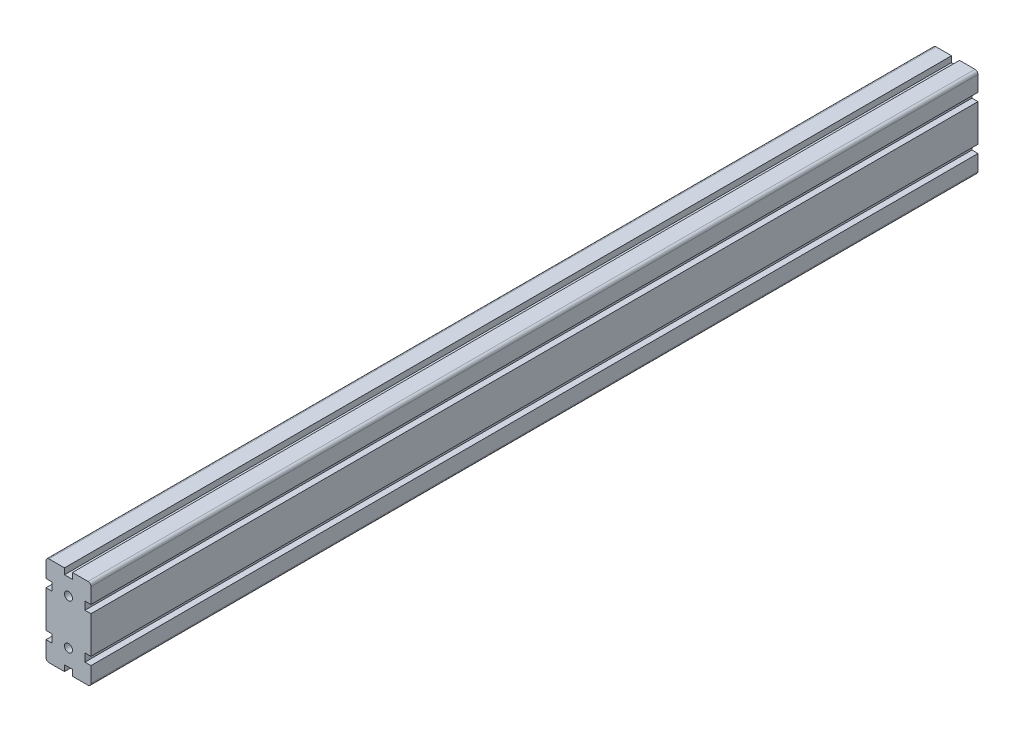
ISO-10303-21;
HEADER;
FILE_DESCRIPTION(('STEP AP214'),'2;1');
FILE_NAME('part.step','',(''),(''),'','','');
FILE_SCHEMA(('AUTOMOTIVE_DESIGN { 1 0 10303 214 1 1 1 1 }'));
ENDSEC;
DATA;
#1=APPLICATION_CONTEXT('core data for automotive mechanical design processes');
#2=APPLICATION_PROTOCOL_DEFINITION('international standard','automotive_design',2000,#1);
#3=PRODUCT_CONTEXT('',#1,'mechanical');
#4=PRODUCT('Part','Part','',(#3));
#5=PRODUCT_RELATED_PRODUCT_CATEGORY('part','',(#4));
#6=PRODUCT_DEFINITION_FORMATION('','',#4);
#7=PRODUCT_DEFINITION_CONTEXT('part definition',#1,'design');
#8=PRODUCT_DEFINITION('design','',#6,#7);
#9=PRODUCT_DEFINITION_SHAPE('','',#8);
#10=(LENGTH_UNIT() NAMED_UNIT(*) SI_UNIT(.MILLI.,.METRE.));
#11=(NAMED_UNIT(*) PLANE_ANGLE_UNIT() SI_UNIT($,.RADIAN.));
#12=(NAMED_UNIT(*) SI_UNIT($,.STERADIAN.) SOLID_ANGLE_UNIT());
#13=UNCERTAINTY_MEASURE_WITH_UNIT(LENGTH_MEASURE(1.E-05),#10,'distance_accuracy_value','');
#14=(GEOMETRIC_REPRESENTATION_CONTEXT(3) GLOBAL_UNCERTAINTY_ASSIGNED_CONTEXT((#13)) GLOBAL_UNIT_ASSIGNED_CONTEXT((#10,
#11,#12)) REPRESENTATION_CONTEXT('',''));
#15=CARTESIAN_POINT('',(0.,0.,0.));
#16=DIRECTION('',(0.,0.,1.));
#17=DIRECTION('',(1.,0.,0.));
#18=AXIS2_PLACEMENT_3D('',#15,#16,#17);
#19=CARTESIAN_POINT('',(-16.5000000000001,26.5,-112.));
#20=DIRECTION('',(-1.,0.,0.));
#21=DIRECTION('',(0.,0.,1.));
#22=AXIS2_PLACEMENT_3D('',#19,#20,#21);
#23=PLANE('',#22);
#24=DIRECTION('',(0.,1.,0.));
#25=VECTOR('',#24,1.);
#26=CARTESIAN_POINT('',(-16.5000000000001,26.5,-1000.));
#27=LINE('',#26,#25);
#28=CARTESIAN_POINT('',(-16.5000000000001,18.5,-1000.));
#29=VERTEX_POINT('',#28);
#30=CARTESIAN_POINT('',(-16.5000000000001,26.5,-1000.));
#31=VERTEX_POINT('',#30);
#32=EDGE_CURVE('E273',#29,#31,#27,.T.);
#33=ORIENTED_EDGE('',*,*,#32,.F.);
#34=DIRECTION('',(0.,0.,-1.));
#35=VECTOR('',#34,1.);
#36=CARTESIAN_POINT('',(-16.5000000000001,18.5,-112.));
#37=LINE('',#36,#35);
#38=CARTESIAN_POINT('',(-16.5000000000001,18.5,-112.));
#39=VERTEX_POINT('',#38);
#40=EDGE_CURVE('E11',#39,#29,#37,.T.);
#41=ORIENTED_EDGE('',*,*,#40,.F.);
#42=DIRECTION('',(0.,1.,0.));
#43=VECTOR('',#42,1.);
#44=CARTESIAN_POINT('',(-16.5000000000001,26.5,-112.));
#45=LINE('',#44,#43);
#46=CARTESIAN_POINT('',(-16.5000000000001,26.5,-112.));
#47=VERTEX_POINT('',#46);
#48=EDGE_CURVE('E366',#39,#47,#45,.T.);
#49=ORIENTED_EDGE('',*,*,#48,.T.);
#50=DIRECTION('',(0.,0.,-1.));
#51=VECTOR('',#50,1.);
#52=CARTESIAN_POINT('',(-16.5000000000001,26.5,-112.));
#53=LINE('',#52,#51);
#54=EDGE_CURVE('E35',#47,#31,#53,.T.);
#55=ORIENTED_EDGE('',*,*,#54,.T.);
#56=EDGE_LOOP('',(#33,#41,#49,#55));
#57=FACE_BOUND('',#56,.T.);
#58=ADVANCED_FACE('F32',(#57),#23,.T.);
#59=CARTESIAN_POINT('',(-22.4999999999999,18.5,-112.));
#60=DIRECTION('',(0.,1.,0.));
#61=DIRECTION('',(0.,0.,1.));
#62=AXIS2_PLACEMENT_3D('',#59,#60,#61);
#63=PLANE('',#62);
#64=DIRECTION('',(1.,0.,0.));
#65=VECTOR('',#64,1.);
#66=CARTESIAN_POINT('',(-22.4999999999999,18.5,-1000.));
#67=LINE('',#66,#65);
#68=CARTESIAN_POINT('',(-22.4999999999999,18.5,-1000.));
#69=VERTEX_POINT('',#68);
#70=EDGE_CURVE('E364',#69,#29,#67,.T.);
#71=ORIENTED_EDGE('',*,*,#70,.F.);
#72=DIRECTION('',(0.,0.,-1.));
#73=VECTOR('',#72,1.);
#74=CARTESIAN_POINT('',(-22.4999999999999,18.5,-112.));
#75=LINE('',#74,#73);
#76=CARTESIAN_POINT('',(-22.4999999999999,18.5,-112.));
#77=VERTEX_POINT('',#76);
#78=EDGE_CURVE('E41',#77,#69,#75,.T.);
#79=ORIENTED_EDGE('',*,*,#78,.F.);
#80=DIRECTION('',(1.,0.,0.));
#81=VECTOR('',#80,1.);
#82=CARTESIAN_POINT('',(-22.4999999999999,18.5,-112.));
#83=LINE('',#82,#81);
#84=EDGE_CURVE('E263',#77,#39,#83,.T.);
#85=ORIENTED_EDGE('',*,*,#84,.T.);
#86=ORIENTED_EDGE('',*,*,#40,.T.);
#87=EDGE_LOOP('',(#71,#79,#85,#86));
#88=FACE_BOUND('',#87,.T.);
#89=ADVANCED_FACE('F426',(#88),#63,.T.);
#90=CARTESIAN_POINT('',(-22.4999999999999,-18.5,-112.));
#91=DIRECTION('',(-1.,0.,0.));
#92=DIRECTION('',(0.,0.,1.));
#93=AXIS2_PLACEMENT_3D('',#90,#91,#92);
#94=PLANE('',#93);
#95=DIRECTION('',(0.,1.,0.));
#96=VECTOR('',#95,1.);
#97=CARTESIAN_POINT('',(-22.4999999999999,-18.5,-1000.));
#98=LINE('',#97,#96);
#99=CARTESIAN_POINT('',(-22.4999999999999,-18.5,-1000.));
#100=VERTEX_POINT('',#99);
#101=EDGE_CURVE('E250',#100,#69,#98,.T.);
#102=ORIENTED_EDGE('',*,*,#101,.F.);
#103=DIRECTION('',(0.,0.,-1.));
#104=VECTOR('',#103,1.);
#105=CARTESIAN_POINT('',(-22.4999999999999,-18.5,-112.));
#106=LINE('',#105,#104);
#107=CARTESIAN_POINT('',(-22.4999999999999,-18.5,-112.));
#108=VERTEX_POINT('',#107);
#109=EDGE_CURVE('E245',#108,#100,#106,.T.);
#110=ORIENTED_EDGE('',*,*,#109,.F.);
#111=DIRECTION('',(0.,1.,0.));
#112=VECTOR('',#111,1.);
#113=CARTESIAN_POINT('',(-22.4999999999999,-18.5,-112.));
#114=LINE('',#113,#112);
#115=EDGE_CURVE('E248',#108,#77,#114,.T.);
#116=ORIENTED_EDGE('',*,*,#115,.T.);
#117=ORIENTED_EDGE('',*,*,#78,.T.);
#118=EDGE_LOOP('',(#102,#110,#116,#117));
#119=FACE_BOUND('',#118,.T.);
#120=ADVANCED_FACE('F247',(#119),#94,.T.);
#121=CARTESIAN_POINT('',(-16.5000000000011,-18.5,-112.));
#122=DIRECTION('',(0.,-1.,0.));
#123=DIRECTION('',(0.,0.,-1.));
#124=AXIS2_PLACEMENT_3D('',#121,#122,#123);
#125=PLANE('',#124);
#126=DIRECTION('',(-1.,0.,0.));
#127=VECTOR('',#126,1.);
#128=CARTESIAN_POINT('',(-16.5000000000011,-18.5,-1000.));
#129=LINE('',#128,#127);
#130=CARTESIAN_POINT('',(-16.5000000000011,-18.5,-1000.));
#131=VERTEX_POINT('',#130);
#132=EDGE_CURVE('E361',#131,#100,#129,.T.);
#133=ORIENTED_EDGE('',*,*,#132,.F.);
#134=DIRECTION('',(0.,0.,-1.));
#135=VECTOR('',#134,1.);
#136=CARTESIAN_POINT('',(-16.5000000000011,-18.5,-112.));
#137=LINE('',#136,#135);
#138=CARTESIAN_POINT('',(-16.5000000000011,-18.5,-112.));
#139=VERTEX_POINT('',#138);
#140=EDGE_CURVE('E255',#139,#131,#137,.T.);
#141=ORIENTED_EDGE('',*,*,#140,.F.);
#142=DIRECTION('',(-1.,0.,0.));
#143=VECTOR('',#142,1.);
#144=CARTESIAN_POINT('',(-16.5000000000011,-18.5,-112.));
#145=LINE('',#144,#143);
#146=EDGE_CURVE('E261',#139,#108,#145,.T.);
#147=ORIENTED_EDGE('',*,*,#146,.T.);
#148=ORIENTED_EDGE('',*,*,#109,.T.);
#149=EDGE_LOOP('',(#133,#141,#147,#148));
#150=FACE_BOUND('',#149,.T.);
#151=ADVANCED_FACE('F265',(#150),#125,.T.);
#152=CARTESIAN_POINT('',(-16.5000000000011,-18.5,-112.));
#153=DIRECTION('',(-1.,0.,0.));
#154=DIRECTION('',(0.,0.,1.));
#155=AXIS2_PLACEMENT_3D('',#152,#153,#154);
#156=PLANE('',#155);
#157=DIRECTION('',(0.,1.,0.));
#158=VECTOR('',#157,1.);
#159=CARTESIAN_POINT('',(-16.5000000000011,-18.5,-1000.));
#160=LINE('',#159,#158);
#161=CARTESIAN_POINT('',(-16.5000000000011,-26.5,-1000.));
#162=VERTEX_POINT('',#161);
#163=EDGE_CURVE('E358',#162,#131,#160,.T.);
#164=ORIENTED_EDGE('',*,*,#163,.F.);
#165=DIRECTION('',(0.,0.,-1.));
#166=VECTOR('',#165,1.);
#167=CARTESIAN_POINT('',(-16.5000000000011,-26.5,-112.));
#168=LINE('',#167,#166);
#169=CARTESIAN_POINT('',(-16.5000000000011,-26.5,-112.));
#170=VERTEX_POINT('',#169);
#171=EDGE_CURVE('E370',#170,#162,#168,.T.);
#172=ORIENTED_EDGE('',*,*,#171,.F.);
#173=DIRECTION('',(0.,1.,0.));
#174=VECTOR('',#173,1.);
#175=CARTESIAN_POINT('',(-16.5000000000011,-18.5,-112.));
#176=LINE('',#175,#174);
#177=EDGE_CURVE('E266',#170,#139,#176,.T.);
#178=ORIENTED_EDGE('',*,*,#177,.T.);
#179=ORIENTED_EDGE('',*,*,#140,.T.);
#180=EDGE_LOOP('',(#164,#172,#178,#179));
#181=FACE_BOUND('',#180,.T.);
#182=ADVANCED_FACE('F439',(#181),#156,.T.);
#183=CARTESIAN_POINT('',(-22.4999999999999,-26.5,-112.));
#184=DIRECTION('',(0.,1.,0.));
#185=DIRECTION('',(0.,0.,1.));
#186=AXIS2_PLACEMENT_3D('',#183,#184,#185);
#187=PLANE('',#186);
#188=DIRECTION('',(1.,0.,0.));
#189=VECTOR('',#188,1.);
#190=CARTESIAN_POINT('',(-22.4999999999999,-26.5,-1000.));
#191=LINE('',#190,#189);
#192=CARTESIAN_POINT('',(-22.4999999999999,-26.5,-1000.));
#193=VERTEX_POINT('',#192);
#194=EDGE_CURVE('E355',#193,#162,#191,.T.);
#195=ORIENTED_EDGE('',*,*,#194,.F.);
#196=DIRECTION('',(0.,0.,-1.));
#197=VECTOR('',#196,1.);
#198=CARTESIAN_POINT('',(-22.4999999999999,-26.5,-112.));
#199=LINE('',#198,#197);
#200=CARTESIAN_POINT('',(-22.4999999999999,-26.5,-112.));
#201=VERTEX_POINT('',#200);
#202=EDGE_CURVE('E372',#201,#193,#199,.T.);
#203=ORIENTED_EDGE('',*,*,#202,.F.);
#204=DIRECTION('',(1.,0.,0.));
#205=VECTOR('',#204,1.);
#206=CARTESIAN_POINT('',(-22.4999999999999,-26.5,-112.));
#207=LINE('',#206,#205);
#208=EDGE_CURVE('E268',#201,#170,#207,.T.);
#209=ORIENTED_EDGE('',*,*,#208,.T.);
#210=ORIENTED_EDGE('',*,*,#171,.T.);
#211=EDGE_LOOP('',(#195,#203,#209,#210));
#212=FACE_BOUND('',#211,.T.);
#213=ADVANCED_FACE('F442',(#212),#187,.T.);
#214=CARTESIAN_POINT('',(-22.4999999999999,-42.,-112.));
#215=DIRECTION('',(-1.,0.,0.));
#216=DIRECTION('',(0.,0.,1.));
#217=AXIS2_PLACEMENT_3D('',#214,#215,#216);
#218=PLANE('',#217);
#219=DIRECTION('',(0.,1.,0.));
#220=VECTOR('',#219,1.);
#221=CARTESIAN_POINT('',(-22.4999999999999,-42.,-1000.));
#222=LINE('',#221,#220);
#223=CARTESIAN_POINT('',(-22.4999999999999,-42.,-1000.));
#224=VERTEX_POINT('',#223);
#225=EDGE_CURVE('E352',#224,#193,#222,.T.);
#226=ORIENTED_EDGE('',*,*,#225,.F.);
#227=DIRECTION('',(0.,0.,-1.));
#228=VECTOR('',#227,1.);
#229=CARTESIAN_POINT('',(-22.4999999999999,-42.,-112.));
#230=LINE('',#229,#228);
#231=CARTESIAN_POINT('',(-22.4999999999999,-42.,-112.));
#232=VERTEX_POINT('',#231);
#233=EDGE_CURVE('E374',#232,#224,#230,.T.);
#234=ORIENTED_EDGE('',*,*,#233,.F.);
#235=DIRECTION('',(0.,1.,0.));
#236=VECTOR('',#235,1.);
#237=CARTESIAN_POINT('',(-22.4999999999999,-42.,-112.));
#238=LINE('',#237,#236);
#239=EDGE_CURVE('E656',#232,#201,#238,.T.);
#240=ORIENTED_EDGE('',*,*,#239,.T.);
#241=ORIENTED_EDGE('',*,*,#202,.T.);
#242=EDGE_LOOP('',(#226,#234,#240,#241));
#243=FACE_BOUND('',#242,.T.);
#244=ADVANCED_FACE('F446',(#243),#218,.T.);
#245=CARTESIAN_POINT('',(-19.4999999999999,-42.,-112.));
#246=DIRECTION('',(0.,0.,-1.));
#247=DIRECTION('',(-1.,0.,0.));
#248=AXIS2_PLACEMENT_3D('',#245,#246,#247);
#249=CYLINDRICAL_SURFACE('',#248,3.00000000000001);
#250=CARTESIAN_POINT('',(-19.4999999999999,-42.,-1000.));
#251=DIRECTION('',(0.,0.,-1.));
#252=DIRECTION('',(-1.,0.,0.));
#253=AXIS2_PLACEMENT_3D('',#250,#251,#252);
#254=CIRCLE('',#253,3.00000000000001);
#255=CARTESIAN_POINT('',(-19.4999999999999,-45.,-1000.));
#256=VERTEX_POINT('',#255);
#257=EDGE_CURVE('E349',#256,#224,#254,.T.);
#258=ORIENTED_EDGE('',*,*,#257,.F.);
#259=DIRECTION('',(0.,0.,-1.));
#260=VECTOR('',#259,1.);
#261=CARTESIAN_POINT('',(-19.4999999999999,-45.,-112.));
#262=LINE('',#261,#260);
#263=CARTESIAN_POINT('',(-19.4999999999999,-45.,-112.));
#264=VERTEX_POINT('',#263);
#265=EDGE_CURVE('E376',#264,#256,#262,.T.);
#266=ORIENTED_EDGE('',*,*,#265,.F.);
#267=CARTESIAN_POINT('',(-19.4999999999999,-42.,-112.));
#268=DIRECTION('',(0.,0.,-1.));
#269=DIRECTION('',(-1.,0.,0.));
#270=AXIS2_PLACEMENT_3D('',#267,#268,#269);
#271=CIRCLE('',#270,3.00000000000001);
#272=EDGE_CURVE('E653',#264,#232,#271,.T.);
#273=ORIENTED_EDGE('',*,*,#272,.T.);
#274=ORIENTED_EDGE('',*,*,#233,.T.);
#275=EDGE_LOOP('',(#258,#266,#273,#274));
#276=FACE_BOUND('',#275,.T.);
#277=ADVANCED_FACE('F450',(#276),#249,.T.);
#278=CARTESIAN_POINT('',(-4.00000000000009,-45.,-112.));
#279=DIRECTION('',(0.,-1.,0.));
#280=DIRECTION('',(1.,0.,0.));
#281=AXIS2_PLACEMENT_3D('',#278,#279,#280);
#282=PLANE('',#281);
#283=DIRECTION('',(-1.,0.,0.));
#284=VECTOR('',#283,1.);
#285=CARTESIAN_POINT('',(-4.00000000000009,-45.,-1000.));
#286=LINE('',#285,#284);
#287=CARTESIAN_POINT('',(-4.00000000000009,-45.,-1000.));
#288=VERTEX_POINT('',#287);
#289=EDGE_CURVE('E346',#288,#256,#286,.T.);
#290=ORIENTED_EDGE('',*,*,#289,.F.);
#291=DIRECTION('',(0.,0.,-1.));
#292=VECTOR('',#291,1.);
#293=CARTESIAN_POINT('',(-4.00000000000009,-45.,-112.));
#294=LINE('',#293,#292);
#295=CARTESIAN_POINT('',(-4.00000000000009,-45.,-112.));
#296=VERTEX_POINT('',#295);
#297=EDGE_CURVE('E378',#296,#288,#294,.T.);
#298=ORIENTED_EDGE('',*,*,#297,.F.);
#299=DIRECTION('',(-1.,0.,0.));
#300=VECTOR('',#299,1.);
#301=CARTESIAN_POINT('',(-4.00000000000009,-45.,-112.));
#302=LINE('',#301,#300);
#303=EDGE_CURVE('E650',#296,#264,#302,.T.);
#304=ORIENTED_EDGE('',*,*,#303,.T.);
#305=ORIENTED_EDGE('',*,*,#265,.T.);
#306=EDGE_LOOP('',(#290,#298,#304,#305));
#307=FACE_BOUND('',#306,.T.);
#308=ADVANCED_FACE('F454',(#307),#282,.T.);
#309=CARTESIAN_POINT('',(-4.00000000000009,-39.,-112.));
#310=DIRECTION('',(1.,0.,0.));
#311=DIRECTION('',(0.,0.,-1.));
#312=AXIS2_PLACEMENT_3D('',#309,#310,#311);
#313=PLANE('',#312);
#314=DIRECTION('',(0.,-1.,0.));
#315=VECTOR('',#314,1.);
#316=CARTESIAN_POINT('',(-4.00000000000009,-39.,-1000.));
#317=LINE('',#316,#315);
#318=CARTESIAN_POINT('',(-4.00000000000009,-39.,-1000.));
#319=VERTEX_POINT('',#318);
#320=EDGE_CURVE('E343',#319,#288,#317,.T.);
#321=ORIENTED_EDGE('',*,*,#320,.F.);
#322=DIRECTION('',(0.,0.,-1.));
#323=VECTOR('',#322,1.);
#324=CARTESIAN_POINT('',(-4.00000000000009,-39.,-112.));
#325=LINE('',#324,#323);
#326=CARTESIAN_POINT('',(-4.00000000000009,-39.,-112.));
#327=VERTEX_POINT('',#326);
#328=EDGE_CURVE('E380',#327,#319,#325,.T.);
#329=ORIENTED_EDGE('',*,*,#328,.F.);
#330=DIRECTION('',(0.,-1.,0.));
#331=VECTOR('',#330,1.);
#332=CARTESIAN_POINT('',(-4.00000000000009,-39.,-112.));
#333=LINE('',#332,#331);
#334=EDGE_CURVE('E647',#327,#296,#333,.T.);
#335=ORIENTED_EDGE('',*,*,#334,.T.);
#336=ORIENTED_EDGE('',*,*,#297,.T.);
#337=EDGE_LOOP('',(#321,#329,#335,#336));
#338=FACE_BOUND('',#337,.T.);
#339=ADVANCED_FACE('F458',(#338),#313,.T.);
#340=CARTESIAN_POINT('',(3.99999999999992,-39.,-112.));
#341=DIRECTION('',(0.,-1.,0.));
#342=DIRECTION('',(0.,0.,-1.));
#343=AXIS2_PLACEMENT_3D('',#340,#341,#342);
#344=PLANE('',#343);
#345=DIRECTION('',(-1.,0.,0.));
#346=VECTOR('',#345,1.);
#347=CARTESIAN_POINT('',(3.99999999999992,-39.,-1000.));
#348=LINE('',#347,#346);
#349=CARTESIAN_POINT('',(3.99999999999992,-39.,-1000.));
#350=VERTEX_POINT('',#349);
#351=EDGE_CURVE('E340',#350,#319,#348,.T.);
#352=ORIENTED_EDGE('',*,*,#351,.F.);
#353=DIRECTION('',(0.,0.,-1.));
#354=VECTOR('',#353,1.);
#355=CARTESIAN_POINT('',(3.99999999999992,-39.,-112.));
#356=LINE('',#355,#354);
#357=CARTESIAN_POINT('',(3.99999999999992,-39.,-112.));
#358=VERTEX_POINT('',#357);
#359=EDGE_CURVE('E382',#358,#350,#356,.T.);
#360=ORIENTED_EDGE('',*,*,#359,.F.);
#361=DIRECTION('',(-1.,0.,0.));
#362=VECTOR('',#361,1.);
#363=CARTESIAN_POINT('',(3.99999999999992,-39.,-112.));
#364=LINE('',#363,#362);
#365=EDGE_CURVE('E644',#358,#327,#364,.T.);
#366=ORIENTED_EDGE('',*,*,#365,.T.);
#367=ORIENTED_EDGE('',*,*,#328,.T.);
#368=EDGE_LOOP('',(#352,#360,#366,#367));
#369=FACE_BOUND('',#368,.T.);
#370=ADVANCED_FACE('F462',(#369),#344,.T.);
#371=CARTESIAN_POINT('',(3.99999999999992,-45.,-112.));
#372=DIRECTION('',(-1.,0.,0.));
#373=DIRECTION('',(0.,0.,1.));
#374=AXIS2_PLACEMENT_3D('',#371,#372,#373);
#375=PLANE('',#374);
#376=DIRECTION('',(0.,1.,0.));
#377=VECTOR('',#376,1.);
#378=CARTESIAN_POINT('',(3.99999999999992,-45.,-1000.));
#379=LINE('',#378,#377);
#380=CARTESIAN_POINT('',(3.99999999999992,-45.,-1000.));
#381=VERTEX_POINT('',#380);
#382=EDGE_CURVE('E337',#381,#350,#379,.T.);
#383=ORIENTED_EDGE('',*,*,#382,.F.);
#384=DIRECTION('',(0.,0.,-1.));
#385=VECTOR('',#384,1.);
#386=CARTESIAN_POINT('',(3.99999999999992,-45.,-112.));
#387=LINE('',#386,#385);
#388=CARTESIAN_POINT('',(3.99999999999992,-45.,-112.));
#389=VERTEX_POINT('',#388);
#390=EDGE_CURVE('E384',#389,#381,#387,.T.);
#391=ORIENTED_EDGE('',*,*,#390,.F.);
#392=DIRECTION('',(0.,1.,0.));
#393=VECTOR('',#392,1.);
#394=CARTESIAN_POINT('',(3.99999999999992,-45.,-112.));
#395=LINE('',#394,#393);
#396=EDGE_CURVE('E641',#389,#358,#395,.T.);
#397=ORIENTED_EDGE('',*,*,#396,.T.);
#398=ORIENTED_EDGE('',*,*,#359,.T.);
#399=EDGE_LOOP('',(#383,#391,#397,#398));
#400=FACE_BOUND('',#399,.T.);
#401=ADVANCED_FACE('F466',(#400),#375,.T.);
#402=CARTESIAN_POINT('',(19.5000000000002,-44.9999999999999,-112.));
#403=DIRECTION('',(0.,-1.,0.));
#404=DIRECTION('',(1.,0.,0.));
#405=AXIS2_PLACEMENT_3D('',#402,#403,#404);
#406=PLANE('',#405);
#407=DIRECTION('',(-1.,0.,0.));
#408=VECTOR('',#407,1.);
#409=CARTESIAN_POINT('',(19.5000000000002,-44.9999999999999,-1000.));
#410=LINE('',#409,#408);
#411=CARTESIAN_POINT('',(19.5000000000002,-44.9999999999999,-1000.));
#412=VERTEX_POINT('',#411);
#413=EDGE_CURVE('E334',#412,#381,#410,.T.);
#414=ORIENTED_EDGE('',*,*,#413,.F.);
#415=DIRECTION('',(0.,0.,-1.));
#416=VECTOR('',#415,1.);
#417=CARTESIAN_POINT('',(19.5000000000002,-44.9999999999999,-112.));
#418=LINE('',#417,#416);
#419=CARTESIAN_POINT('',(19.5000000000002,-44.9999999999999,-112.));
#420=VERTEX_POINT('',#419);
#421=EDGE_CURVE('E386',#420,#412,#418,.T.);
#422=ORIENTED_EDGE('',*,*,#421,.F.);
#423=DIRECTION('',(-1.,0.,0.));
#424=VECTOR('',#423,1.);
#425=CARTESIAN_POINT('',(19.5000000000002,-44.9999999999999,-112.));
#426=LINE('',#425,#424);
#427=EDGE_CURVE('E638',#420,#389,#426,.T.);
#428=ORIENTED_EDGE('',*,*,#427,.T.);
#429=ORIENTED_EDGE('',*,*,#390,.T.);
#430=EDGE_LOOP('',(#414,#422,#428,#429));
#431=FACE_BOUND('',#430,.T.);
#432=ADVANCED_FACE('F470',(#431),#406,.T.);
#433=CARTESIAN_POINT('',(19.5000000000002,-41.9999999999999,-112.));
#434=DIRECTION('',(0.,0.,-1.));
#435=DIRECTION('',(-1.,0.,0.));
#436=AXIS2_PLACEMENT_3D('',#433,#434,#435);
#437=CYLINDRICAL_SURFACE('',#436,3.);
#438=CARTESIAN_POINT('',(19.5000000000002,-41.9999999999999,-1000.));
#439=DIRECTION('',(0.,0.,-1.));
#440=DIRECTION('',(-1.,0.,0.));
#441=AXIS2_PLACEMENT_3D('',#438,#439,#440);
#442=CIRCLE('',#441,3.);
#443=CARTESIAN_POINT('',(22.5000000000001,-41.9999999999999,-1000.));
#444=VERTEX_POINT('',#443);
#445=EDGE_CURVE('E331',#444,#412,#442,.T.);
#446=ORIENTED_EDGE('',*,*,#445,.F.);
#447=DIRECTION('',(0.,0.,-1.));
#448=VECTOR('',#447,1.);
#449=CARTESIAN_POINT('',(22.5000000000001,-41.9999999999999,-112.));
#450=LINE('',#449,#448);
#451=CARTESIAN_POINT('',(22.5000000000001,-41.9999999999999,-112.));
#452=VERTEX_POINT('',#451);
#453=EDGE_CURVE('E388',#452,#444,#450,.T.);
#454=ORIENTED_EDGE('',*,*,#453,.F.);
#455=CARTESIAN_POINT('',(19.5000000000002,-41.9999999999999,-112.));
#456=DIRECTION('',(0.,0.,-1.));
#457=DIRECTION('',(-1.,0.,0.));
#458=AXIS2_PLACEMENT_3D('',#455,#456,#457);
#459=CIRCLE('',#458,3.);
#460=EDGE_CURVE('E635',#452,#420,#459,.T.);
#461=ORIENTED_EDGE('',*,*,#460,.T.);
#462=ORIENTED_EDGE('',*,*,#421,.T.);
#463=EDGE_LOOP('',(#446,#454,#461,#462));
#464=FACE_BOUND('',#463,.T.);
#465=ADVANCED_FACE('F474',(#464),#437,.T.);
#466=CARTESIAN_POINT('',(22.4999999999999,-26.5,-112.));
#467=DIRECTION('',(1.,0.,0.));
#468=DIRECTION('',(0.,1.,0.));
#469=AXIS2_PLACEMENT_3D('',#466,#467,#468);
#470=PLANE('',#469);
#471=DIRECTION('',(0.,-1.,0.));
#472=VECTOR('',#471,1.);
#473=CARTESIAN_POINT('',(22.4999999999999,-26.5,-1000.));
#474=LINE('',#473,#472);
#475=CARTESIAN_POINT('',(22.4999999999999,-26.5,-1000.));
#476=VERTEX_POINT('',#475);
#477=EDGE_CURVE('E328',#476,#444,#474,.T.);
#478=ORIENTED_EDGE('',*,*,#477,.F.);
#479=DIRECTION('',(0.,0.,-1.));
#480=VECTOR('',#479,1.);
#481=CARTESIAN_POINT('',(22.4999999999999,-26.5,-112.));
#482=LINE('',#481,#480);
#483=CARTESIAN_POINT('',(22.4999999999999,-26.5,-112.));
#484=VERTEX_POINT('',#483);
#485=EDGE_CURVE('E390',#484,#476,#482,.T.);
#486=ORIENTED_EDGE('',*,*,#485,.F.);
#487=DIRECTION('',(0.,-1.,0.));
#488=VECTOR('',#487,1.);
#489=CARTESIAN_POINT('',(22.4999999999999,-26.5,-112.));
#490=LINE('',#489,#488);
#491=EDGE_CURVE('E632',#484,#452,#490,.T.);
#492=ORIENTED_EDGE('',*,*,#491,.T.);
#493=ORIENTED_EDGE('',*,*,#453,.T.);
#494=EDGE_LOOP('',(#478,#486,#492,#493));
#495=FACE_BOUND('',#494,.T.);
#496=ADVANCED_FACE('F478',(#495),#470,.T.);
#497=CARTESIAN_POINT('',(16.4999999999989,-26.5,-112.));
#498=DIRECTION('',(0.,1.,0.));
#499=DIRECTION('',(0.,0.,1.));
#500=AXIS2_PLACEMENT_3D('',#497,#498,#499);
#501=PLANE('',#500);
#502=DIRECTION('',(1.,0.,0.));
#503=VECTOR('',#502,1.);
#504=CARTESIAN_POINT('',(16.4999999999989,-26.5,-1000.));
#505=LINE('',#504,#503);
#506=CARTESIAN_POINT('',(16.4999999999989,-26.5,-1000.));
#507=VERTEX_POINT('',#506);
#508=EDGE_CURVE('E325',#507,#476,#505,.T.);
#509=ORIENTED_EDGE('',*,*,#508,.F.);
#510=DIRECTION('',(0.,0.,-1.));
#511=VECTOR('',#510,1.);
#512=CARTESIAN_POINT('',(16.4999999999989,-26.5,-112.));
#513=LINE('',#512,#511);
#514=CARTESIAN_POINT('',(16.4999999999989,-26.5,-112.));
#515=VERTEX_POINT('',#514);
#516=EDGE_CURVE('E392',#515,#507,#513,.T.);
#517=ORIENTED_EDGE('',*,*,#516,.F.);
#518=DIRECTION('',(1.,0.,0.));
#519=VECTOR('',#518,1.);
#520=CARTESIAN_POINT('',(16.4999999999989,-26.5,-112.));
#521=LINE('',#520,#519);
#522=EDGE_CURVE('E629',#515,#484,#521,.T.);
#523=ORIENTED_EDGE('',*,*,#522,.T.);
#524=ORIENTED_EDGE('',*,*,#485,.T.);
#525=EDGE_LOOP('',(#509,#517,#523,#524));
#526=FACE_BOUND('',#525,.T.);
#527=ADVANCED_FACE('F482',(#526),#501,.T.);
#528=CARTESIAN_POINT('',(16.4999999999989,-18.5,-112.));
#529=DIRECTION('',(1.,0.,0.));
#530=DIRECTION('',(0.,0.,-1.));
#531=AXIS2_PLACEMENT_3D('',#528,#529,#530);
#532=PLANE('',#531);
#533=DIRECTION('',(0.,-1.,0.));
#534=VECTOR('',#533,1.);
#535=CARTESIAN_POINT('',(16.4999999999989,-18.5,-1000.));
#536=LINE('',#535,#534);
#537=CARTESIAN_POINT('',(16.4999999999989,-18.5,-1000.));
#538=VERTEX_POINT('',#537);
#539=EDGE_CURVE('E322',#538,#507,#536,.T.);
#540=ORIENTED_EDGE('',*,*,#539,.F.);
#541=DIRECTION('',(0.,0.,-1.));
#542=VECTOR('',#541,1.);
#543=CARTESIAN_POINT('',(16.4999999999989,-18.5,-112.));
#544=LINE('',#543,#542);
#545=CARTESIAN_POINT('',(16.4999999999989,-18.5,-112.));
#546=VERTEX_POINT('',#545);
#547=EDGE_CURVE('E394',#546,#538,#544,.T.);
#548=ORIENTED_EDGE('',*,*,#547,.F.);
#549=DIRECTION('',(0.,-1.,0.));
#550=VECTOR('',#549,1.);
#551=CARTESIAN_POINT('',(16.4999999999989,-18.5,-112.));
#552=LINE('',#551,#550);
#553=EDGE_CURVE('E626',#546,#515,#552,.T.);
#554=ORIENTED_EDGE('',*,*,#553,.T.);
#555=ORIENTED_EDGE('',*,*,#516,.T.);
#556=EDGE_LOOP('',(#540,#548,#554,#555));
#557=FACE_BOUND('',#556,.T.);
#558=ADVANCED_FACE('F486',(#557),#532,.T.);
#559=CARTESIAN_POINT('',(22.4999999999999,-18.5,-112.));
#560=DIRECTION('',(0.,-1.,0.));
#561=DIRECTION('',(0.,0.,-1.));
#562=AXIS2_PLACEMENT_3D('',#559,#560,#561);
#563=PLANE('',#562);
#564=DIRECTION('',(-1.,0.,0.));
#565=VECTOR('',#564,1.);
#566=CARTESIAN_POINT('',(22.4999999999999,-18.5,-1000.));
#567=LINE('',#566,#565);
#568=CARTESIAN_POINT('',(22.4999999999999,-18.5,-1000.));
#569=VERTEX_POINT('',#568);
#570=EDGE_CURVE('E319',#569,#538,#567,.T.);
#571=ORIENTED_EDGE('',*,*,#570,.F.);
#572=DIRECTION('',(0.,0.,-1.));
#573=VECTOR('',#572,1.);
#574=CARTESIAN_POINT('',(22.4999999999999,-18.5,-112.));
#575=LINE('',#574,#573);
#576=CARTESIAN_POINT('',(22.4999999999999,-18.5,-112.));
#577=VERTEX_POINT('',#576);
#578=EDGE_CURVE('E396',#577,#569,#575,.T.);
#579=ORIENTED_EDGE('',*,*,#578,.F.);
#580=DIRECTION('',(-1.,0.,0.));
#581=VECTOR('',#580,1.);
#582=CARTESIAN_POINT('',(22.4999999999999,-18.5,-112.));
#583=LINE('',#582,#581);
#584=EDGE_CURVE('E623',#577,#546,#583,.T.);
#585=ORIENTED_EDGE('',*,*,#584,.T.);
#586=ORIENTED_EDGE('',*,*,#547,.T.);
#587=EDGE_LOOP('',(#571,#579,#585,#586));
#588=FACE_BOUND('',#587,.T.);
#589=ADVANCED_FACE('F490',(#588),#563,.T.);
#590=CARTESIAN_POINT('',(22.4999999999999,18.5,-112.));
#591=DIRECTION('',(1.,0.,0.));
#592=DIRECTION('',(0.,1.,0.));
#593=AXIS2_PLACEMENT_3D('',#590,#591,#592);
#594=PLANE('',#593);
#595=DIRECTION('',(0.,-1.,0.));
#596=VECTOR('',#595,1.);
#597=CARTESIAN_POINT('',(22.4999999999999,18.5,-1000.));
#598=LINE('',#597,#596);
#599=CARTESIAN_POINT('',(22.4999999999999,18.5,-1000.));
#600=VERTEX_POINT('',#599);
#601=EDGE_CURVE('E316',#600,#569,#598,.T.);
#602=ORIENTED_EDGE('',*,*,#601,.F.);
#603=DIRECTION('',(0.,0.,-1.));
#604=VECTOR('',#603,1.);
#605=CARTESIAN_POINT('',(22.4999999999999,18.5,-112.));
#606=LINE('',#605,#604);
#607=CARTESIAN_POINT('',(22.4999999999999,18.5,-112.));
#608=VERTEX_POINT('',#607);
#609=EDGE_CURVE('E398',#608,#600,#606,.T.);
#610=ORIENTED_EDGE('',*,*,#609,.F.);
#611=DIRECTION('',(0.,-1.,0.));
#612=VECTOR('',#611,1.);
#613=CARTESIAN_POINT('',(22.4999999999999,18.5,-112.));
#614=LINE('',#613,#612);
#615=EDGE_CURVE('E620',#608,#577,#614,.T.);
#616=ORIENTED_EDGE('',*,*,#615,.T.);
#617=ORIENTED_EDGE('',*,*,#578,.T.);
#618=EDGE_LOOP('',(#602,#610,#616,#617));
#619=FACE_BOUND('',#618,.T.);
#620=ADVANCED_FACE('F494',(#619),#594,.T.);
#621=CARTESIAN_POINT('',(16.4999999999999,18.5,-112.));
#622=DIRECTION('',(0.,1.,0.));
#623=DIRECTION('',(0.,0.,1.));
#624=AXIS2_PLACEMENT_3D('',#621,#622,#623);
#625=PLANE('',#624);
#626=DIRECTION('',(1.,0.,0.));
#627=VECTOR('',#626,1.);
#628=CARTESIAN_POINT('',(16.4999999999999,18.5,-1000.));
#629=LINE('',#628,#627);
#630=CARTESIAN_POINT('',(16.4999999999999,18.5,-1000.));
#631=VERTEX_POINT('',#630);
#632=EDGE_CURVE('E313',#631,#600,#629,.T.);
#633=ORIENTED_EDGE('',*,*,#632,.F.);
#634=DIRECTION('',(0.,0.,-1.));
#635=VECTOR('',#634,1.);
#636=CARTESIAN_POINT('',(16.4999999999999,18.5,-112.));
#637=LINE('',#636,#635);
#638=CARTESIAN_POINT('',(16.4999999999999,18.5,-112.));
#639=VERTEX_POINT('',#638);
#640=EDGE_CURVE('E400',#639,#631,#637,.T.);
#641=ORIENTED_EDGE('',*,*,#640,.F.);
#642=DIRECTION('',(1.,0.,0.));
#643=VECTOR('',#642,1.);
#644=CARTESIAN_POINT('',(16.4999999999999,18.5,-112.));
#645=LINE('',#644,#643);
#646=EDGE_CURVE('E617',#639,#608,#645,.T.);
#647=ORIENTED_EDGE('',*,*,#646,.T.);
#648=ORIENTED_EDGE('',*,*,#609,.T.);
#649=EDGE_LOOP('',(#633,#641,#647,#648));
#650=FACE_BOUND('',#649,.T.);
#651=ADVANCED_FACE('F498',(#650),#625,.T.);
#652=CARTESIAN_POINT('',(16.4999999999999,26.5,-112.));
#653=DIRECTION('',(1.,0.,0.));
#654=DIRECTION('',(0.,0.,-1.));
#655=AXIS2_PLACEMENT_3D('',#652,#653,#654);
#656=PLANE('',#655);
#657=DIRECTION('',(0.,-1.,0.));
#658=VECTOR('',#657,1.);
#659=CARTESIAN_POINT('',(16.4999999999999,26.5,-1000.));
#660=LINE('',#659,#658);
#661=CARTESIAN_POINT('',(16.4999999999999,26.5,-1000.));
#662=VERTEX_POINT('',#661);
#663=EDGE_CURVE('E310',#662,#631,#660,.T.);
#664=ORIENTED_EDGE('',*,*,#663,.F.);
#665=DIRECTION('',(0.,0.,-1.));
#666=VECTOR('',#665,1.);
#667=CARTESIAN_POINT('',(16.4999999999999,26.5,-112.));
#668=LINE('',#667,#666);
#669=CARTESIAN_POINT('',(16.4999999999999,26.5,-112.));
#670=VERTEX_POINT('',#669);
#671=EDGE_CURVE('E402',#670,#662,#668,.T.);
#672=ORIENTED_EDGE('',*,*,#671,.F.);
#673=DIRECTION('',(0.,-1.,0.));
#674=VECTOR('',#673,1.);
#675=CARTESIAN_POINT('',(16.4999999999999,26.5,-112.));
#676=LINE('',#675,#674);
#677=EDGE_CURVE('E614',#670,#639,#676,.T.);
#678=ORIENTED_EDGE('',*,*,#677,.T.);
#679=ORIENTED_EDGE('',*,*,#640,.T.);
#680=EDGE_LOOP('',(#664,#672,#678,#679));
#681=FACE_BOUND('',#680,.T.);
#682=ADVANCED_FACE('F502',(#681),#656,.T.);
#683=CARTESIAN_POINT('',(22.4999999999999,26.5,-112.));
#684=DIRECTION('',(0.,-1.,0.));
#685=DIRECTION('',(0.,0.,-1.));
#686=AXIS2_PLACEMENT_3D('',#683,#684,#685);
#687=PLANE('',#686);
#688=DIRECTION('',(-1.,0.,0.));
#689=VECTOR('',#688,1.);
#690=CARTESIAN_POINT('',(22.4999999999999,26.5,-1000.));
#691=LINE('',#690,#689);
#692=CARTESIAN_POINT('',(22.4999999999999,26.5,-1000.));
#693=VERTEX_POINT('',#692);
#694=EDGE_CURVE('E307',#693,#662,#691,.T.);
#695=ORIENTED_EDGE('',*,*,#694,.F.);
#696=DIRECTION('',(0.,0.,-1.));
#697=VECTOR('',#696,1.);
#698=CARTESIAN_POINT('',(22.4999999999999,26.5,-112.));
#699=LINE('',#698,#697);
#700=CARTESIAN_POINT('',(22.4999999999999,26.5,-112.));
#701=VERTEX_POINT('',#700);
#702=EDGE_CURVE('E404',#701,#693,#699,.T.);
#703=ORIENTED_EDGE('',*,*,#702,.F.);
#704=DIRECTION('',(-1.,0.,0.));
#705=VECTOR('',#704,1.);
#706=CARTESIAN_POINT('',(22.4999999999999,26.5,-112.));
#707=LINE('',#706,#705);
#708=EDGE_CURVE('E611',#701,#670,#707,.T.);
#709=ORIENTED_EDGE('',*,*,#708,.T.);
#710=ORIENTED_EDGE('',*,*,#671,.T.);
#711=EDGE_LOOP('',(#695,#703,#709,#710));
#712=FACE_BOUND('',#711,.T.);
#713=ADVANCED_FACE('F506',(#712),#687,.T.);
#714=CARTESIAN_POINT('',(22.4999999999999,42.0000000000001,-112.));
#715=DIRECTION('',(1.,0.,0.));
#716=DIRECTION('',(0.,1.,0.));
#717=AXIS2_PLACEMENT_3D('',#714,#715,#716);
#718=PLANE('',#717);
#719=DIRECTION('',(0.,-1.,0.));
#720=VECTOR('',#719,1.);
#721=CARTESIAN_POINT('',(22.4999999999999,42.0000000000001,-1000.));
#722=LINE('',#721,#720);
#723=CARTESIAN_POINT('',(22.4999999999998,42.0000000000001,-1000.));
#724=VERTEX_POINT('',#723);
#725=EDGE_CURVE('E304',#724,#693,#722,.T.);
#726=ORIENTED_EDGE('',*,*,#725,.F.);
#727=DIRECTION('',(0.,0.,-1.));
#728=VECTOR('',#727,1.);
#729=CARTESIAN_POINT('',(22.4999999999998,42.0000000000001,-112.));
#730=LINE('',#729,#728);
#731=CARTESIAN_POINT('',(22.4999999999998,42.0000000000001,-112.));
#732=VERTEX_POINT('',#731);
#733=EDGE_CURVE('E406',#732,#724,#730,.T.);
#734=ORIENTED_EDGE('',*,*,#733,.F.);
#735=DIRECTION('',(0.,-1.,0.));
#736=VECTOR('',#735,1.);
#737=CARTESIAN_POINT('',(22.4999999999999,42.0000000000001,-112.));
#738=LINE('',#737,#736);
#739=EDGE_CURVE('E608',#732,#701,#738,.T.);
#740=ORIENTED_EDGE('',*,*,#739,.T.);
#741=ORIENTED_EDGE('',*,*,#702,.T.);
#742=EDGE_LOOP('',(#726,#734,#740,#741));
#743=FACE_BOUND('',#742,.T.);
#744=ADVANCED_FACE('F510',(#743),#718,.T.);
#745=CARTESIAN_POINT('',(19.4999999999999,42.0000000000001,-112.));
#746=DIRECTION('',(0.,0.,-1.));
#747=DIRECTION('',(-1.,0.,0.));
#748=AXIS2_PLACEMENT_3D('',#745,#746,#747);
#749=CYLINDRICAL_SURFACE('',#748,2.99999999999998);
#750=CARTESIAN_POINT('',(19.4999999999999,42.0000000000001,-1000.));
#751=DIRECTION('',(0.,0.,-1.));
#752=DIRECTION('',(-1.,0.,0.));
#753=AXIS2_PLACEMENT_3D('',#750,#751,#752);
#754=CIRCLE('',#753,2.99999999999998);
#755=CARTESIAN_POINT('',(19.4999999999999,45.0000000000001,-1000.));
#756=VERTEX_POINT('',#755);
#757=EDGE_CURVE('E301',#756,#724,#754,.T.);
#758=ORIENTED_EDGE('',*,*,#757,.F.);
#759=DIRECTION('',(0.,0.,-1.));
#760=VECTOR('',#759,1.);
#761=CARTESIAN_POINT('',(19.4999999999999,45.0000000000001,-112.));
#762=LINE('',#761,#760);
#763=CARTESIAN_POINT('',(19.4999999999999,45.0000000000001,-112.));
#764=VERTEX_POINT('',#763);
#765=EDGE_CURVE('E408',#764,#756,#762,.T.);
#766=ORIENTED_EDGE('',*,*,#765,.F.);
#767=CARTESIAN_POINT('',(19.4999999999999,42.0000000000001,-112.));
#768=DIRECTION('',(0.,0.,-1.));
#769=DIRECTION('',(-1.,0.,0.));
#770=AXIS2_PLACEMENT_3D('',#767,#768,#769);
#771=CIRCLE('',#770,2.99999999999998);
#772=EDGE_CURVE('E605',#764,#732,#771,.T.);
#773=ORIENTED_EDGE('',*,*,#772,.T.);
#774=ORIENTED_EDGE('',*,*,#733,.T.);
#775=EDGE_LOOP('',(#758,#766,#773,#774));
#776=FACE_BOUND('',#775,.T.);
#777=ADVANCED_FACE('F514',(#776),#749,.T.);
#778=CARTESIAN_POINT('',(3.99999999999992,44.9999999999999,-112.));
#779=DIRECTION('',(0.,1.,0.));
#780=DIRECTION('',(-1.,0.,0.));
#781=AXIS2_PLACEMENT_3D('',#778,#779,#780);
#782=PLANE('',#781);
#783=DIRECTION('',(1.,0.,0.));
#784=VECTOR('',#783,1.);
#785=CARTESIAN_POINT('',(3.99999999999992,44.9999999999999,-1000.));
#786=LINE('',#785,#784);
#787=CARTESIAN_POINT('',(3.99999999999992,44.9999999999999,-1000.));
#788=VERTEX_POINT('',#787);
#789=EDGE_CURVE('E298',#788,#756,#786,.T.);
#790=ORIENTED_EDGE('',*,*,#789,.F.);
#791=DIRECTION('',(0.,0.,-1.));
#792=VECTOR('',#791,1.);
#793=CARTESIAN_POINT('',(3.99999999999992,44.9999999999999,-112.));
#794=LINE('',#793,#792);
#795=CARTESIAN_POINT('',(3.99999999999992,44.9999999999999,-112.));
#796=VERTEX_POINT('',#795);
#797=EDGE_CURVE('E410',#796,#788,#794,.T.);
#798=ORIENTED_EDGE('',*,*,#797,.F.);
#799=DIRECTION('',(1.,0.,0.));
#800=VECTOR('',#799,1.);
#801=CARTESIAN_POINT('',(3.99999999999992,44.9999999999999,-112.));
#802=LINE('',#801,#800);
#803=EDGE_CURVE('E602',#796,#764,#802,.T.);
#804=ORIENTED_EDGE('',*,*,#803,.T.);
#805=ORIENTED_EDGE('',*,*,#765,.T.);
#806=EDGE_LOOP('',(#790,#798,#804,#805));
#807=FACE_BOUND('',#806,.T.);
#808=ADVANCED_FACE('F518',(#807),#782,.T.);
#809=CARTESIAN_POINT('',(3.99999999999992,39.,-112.));
#810=DIRECTION('',(-1.,0.,0.));
#811=DIRECTION('',(0.,0.,1.));
#812=AXIS2_PLACEMENT_3D('',#809,#810,#811);
#813=PLANE('',#812);
#814=DIRECTION('',(0.,1.,0.));
#815=VECTOR('',#814,1.);
#816=CARTESIAN_POINT('',(3.99999999999992,39.,-1000.));
#817=LINE('',#816,#815);
#818=CARTESIAN_POINT('',(3.99999999999992,39.,-1000.));
#819=VERTEX_POINT('',#818);
#820=EDGE_CURVE('E295',#819,#788,#817,.T.);
#821=ORIENTED_EDGE('',*,*,#820,.F.);
#822=DIRECTION('',(0.,0.,-1.));
#823=VECTOR('',#822,1.);
#824=CARTESIAN_POINT('',(3.99999999999992,39.,-112.));
#825=LINE('',#824,#823);
#826=CARTESIAN_POINT('',(3.99999999999992,39.,-112.));
#827=VERTEX_POINT('',#826);
#828=EDGE_CURVE('E412',#827,#819,#825,.T.);
#829=ORIENTED_EDGE('',*,*,#828,.F.);
#830=DIRECTION('',(0.,1.,0.));
#831=VECTOR('',#830,1.);
#832=CARTESIAN_POINT('',(3.99999999999992,39.,-112.));
#833=LINE('',#832,#831);
#834=EDGE_CURVE('E599',#827,#796,#833,.T.);
#835=ORIENTED_EDGE('',*,*,#834,.T.);
#836=ORIENTED_EDGE('',*,*,#797,.T.);
#837=EDGE_LOOP('',(#821,#829,#835,#836));
#838=FACE_BOUND('',#837,.T.);
#839=ADVANCED_FACE('F522',(#838),#813,.T.);
#840=CARTESIAN_POINT('',(3.99999999999992,39.,-112.));
#841=DIRECTION('',(0.,1.,0.));
#842=DIRECTION('',(0.,0.,1.));
#843=AXIS2_PLACEMENT_3D('',#840,#841,#842);
#844=PLANE('',#843);
#845=DIRECTION('',(1.,0.,0.));
#846=VECTOR('',#845,1.);
#847=CARTESIAN_POINT('',(3.99999999999992,39.,-1000.));
#848=LINE('',#847,#846);
#849=CARTESIAN_POINT('',(-4.00000000000007,39.,-1000.));
#850=VERTEX_POINT('',#849);
#851=EDGE_CURVE('E292',#850,#819,#848,.T.);
#852=ORIENTED_EDGE('',*,*,#851,.F.);
#853=DIRECTION('',(0.,0.,-1.));
#854=VECTOR('',#853,1.);
#855=CARTESIAN_POINT('',(-4.00000000000007,39.,-112.));
#856=LINE('',#855,#854);
#857=CARTESIAN_POINT('',(-4.00000000000007,39.,-112.));
#858=VERTEX_POINT('',#857);
#859=EDGE_CURVE('E414',#858,#850,#856,.T.);
#860=ORIENTED_EDGE('',*,*,#859,.F.);
#861=DIRECTION('',(1.,0.,0.));
#862=VECTOR('',#861,1.);
#863=CARTESIAN_POINT('',(3.99999999999992,39.,-112.));
#864=LINE('',#863,#862);
#865=EDGE_CURVE('E596',#858,#827,#864,.T.);
#866=ORIENTED_EDGE('',*,*,#865,.T.);
#867=ORIENTED_EDGE('',*,*,#828,.T.);
#868=EDGE_LOOP('',(#852,#860,#866,#867));
#869=FACE_BOUND('',#868,.T.);
#870=ADVANCED_FACE('F526',(#869),#844,.T.);
#871=CARTESIAN_POINT('',(-4.00000000000007,44.9999999999999,-112.));
#872=DIRECTION('',(1.,0.,0.));
#873=DIRECTION('',(0.,0.,-1.));
#874=AXIS2_PLACEMENT_3D('',#871,#872,#873);
#875=PLANE('',#874);
#876=DIRECTION('',(0.,-1.,0.));
#877=VECTOR('',#876,1.);
#878=CARTESIAN_POINT('',(-4.00000000000007,44.9999999999999,-1000.));
#879=LINE('',#878,#877);
#880=CARTESIAN_POINT('',(-4.00000000000007,44.9999999999999,-1000.));
#881=VERTEX_POINT('',#880);
#882=EDGE_CURVE('E289',#881,#850,#879,.T.);
#883=ORIENTED_EDGE('',*,*,#882,.F.);
#884=DIRECTION('',(0.,0.,-1.));
#885=VECTOR('',#884,1.);
#886=CARTESIAN_POINT('',(-4.00000000000007,44.9999999999999,-112.));
#887=LINE('',#886,#885);
#888=CARTESIAN_POINT('',(-4.00000000000007,44.9999999999999,-112.));
#889=VERTEX_POINT('',#888);
#890=EDGE_CURVE('E416',#889,#881,#887,.T.);
#891=ORIENTED_EDGE('',*,*,#890,.F.);
#892=DIRECTION('',(0.,-1.,0.));
#893=VECTOR('',#892,1.);
#894=CARTESIAN_POINT('',(-4.00000000000007,44.9999999999999,-112.));
#895=LINE('',#894,#893);
#896=EDGE_CURVE('E593',#889,#858,#895,.T.);
#897=ORIENTED_EDGE('',*,*,#896,.T.);
#898=ORIENTED_EDGE('',*,*,#859,.T.);
#899=EDGE_LOOP('',(#883,#891,#897,#898));
#900=FACE_BOUND('',#899,.T.);
#901=ADVANCED_FACE('F530',(#900),#875,.T.);
#902=CARTESIAN_POINT('',(-19.5000000000002,44.9999999999999,-112.));
#903=DIRECTION('',(0.,1.,0.));
#904=DIRECTION('',(0.,0.,1.));
#905=AXIS2_PLACEMENT_3D('',#902,#903,#904);
#906=PLANE('',#905);
#907=DIRECTION('',(1.,0.,0.));
#908=VECTOR('',#907,1.);
#909=CARTESIAN_POINT('',(-19.5000000000002,44.9999999999999,-1000.));
#910=LINE('',#909,#908);
#911=CARTESIAN_POINT('',(-19.5000000000002,44.9999999999999,-1000.));
#912=VERTEX_POINT('',#911);
#913=EDGE_CURVE('E286',#912,#881,#910,.T.);
#914=ORIENTED_EDGE('',*,*,#913,.F.);
#915=DIRECTION('',(0.,0.,-1.));
#916=VECTOR('',#915,1.);
#917=CARTESIAN_POINT('',(-19.5000000000002,44.9999999999999,-112.));
#918=LINE('',#917,#916);
#919=CARTESIAN_POINT('',(-19.5000000000002,44.9999999999999,-112.));
#920=VERTEX_POINT('',#919);
#921=EDGE_CURVE('E418',#920,#912,#918,.T.);
#922=ORIENTED_EDGE('',*,*,#921,.F.);
#923=DIRECTION('',(1.,0.,0.));
#924=VECTOR('',#923,1.);
#925=CARTESIAN_POINT('',(-19.5000000000002,44.9999999999999,-112.));
#926=LINE('',#925,#924);
#927=EDGE_CURVE('E590',#920,#889,#926,.T.);
#928=ORIENTED_EDGE('',*,*,#927,.T.);
#929=ORIENTED_EDGE('',*,*,#890,.T.);
#930=EDGE_LOOP('',(#914,#922,#928,#929));
#931=FACE_BOUND('',#930,.T.);
#932=ADVANCED_FACE('F534',(#931),#906,.T.);
#933=CARTESIAN_POINT('',(-19.5000000000002,41.9999999999999,-112.));
#934=DIRECTION('',(0.,0.,-1.));
#935=DIRECTION('',(-1.,0.,0.));
#936=AXIS2_PLACEMENT_3D('',#933,#934,#935);
#937=CYLINDRICAL_SURFACE('',#936,2.99999999999998);
#938=CARTESIAN_POINT('',(-19.5000000000002,41.9999999999999,-1000.));
#939=DIRECTION('',(0.,0.,-1.));
#940=DIRECTION('',(-1.,0.,0.));
#941=AXIS2_PLACEMENT_3D('',#938,#939,#940);
#942=CIRCLE('',#941,2.99999999999998);
#943=CARTESIAN_POINT('',(-22.5000000000001,41.9999999999999,-1000.));
#944=VERTEX_POINT('',#943);
#945=EDGE_CURVE('E283',#944,#912,#942,.T.);
#946=ORIENTED_EDGE('',*,*,#945,.F.);
#947=DIRECTION('',(0.,0.,-1.));
#948=VECTOR('',#947,1.);
#949=CARTESIAN_POINT('',(-22.5000000000001,41.9999999999999,-112.));
#950=LINE('',#949,#948);
#951=CARTESIAN_POINT('',(-22.5000000000001,41.9999999999999,-112.));
#952=VERTEX_POINT('',#951);
#953=EDGE_CURVE('E420',#952,#944,#950,.T.);
#954=ORIENTED_EDGE('',*,*,#953,.F.);
#955=CARTESIAN_POINT('',(-19.5000000000002,41.9999999999999,-112.));
#956=DIRECTION('',(0.,0.,-1.));
#957=DIRECTION('',(-1.,0.,0.));
#958=AXIS2_PLACEMENT_3D('',#955,#956,#957);
#959=CIRCLE('',#958,2.99999999999998);
#960=EDGE_CURVE('E587',#952,#920,#959,.T.);
#961=ORIENTED_EDGE('',*,*,#960,.T.);
#962=ORIENTED_EDGE('',*,*,#921,.T.);
#963=EDGE_LOOP('',(#946,#954,#961,#962));
#964=FACE_BOUND('',#963,.T.);
#965=ADVANCED_FACE('F538',(#964),#937,.T.);
#966=CARTESIAN_POINT('',(-22.4999999999999,26.5,-112.));
#967=DIRECTION('',(-1.,0.,0.));
#968=DIRECTION('',(0.,-1.,0.));
#969=AXIS2_PLACEMENT_3D('',#966,#967,#968);
#970=PLANE('',#969);
#971=DIRECTION('',(0.,1.,0.));
#972=VECTOR('',#971,1.);
#973=CARTESIAN_POINT('',(-22.4999999999999,26.5,-1000.));
#974=LINE('',#973,#972);
#975=CARTESIAN_POINT('',(-22.4999999999999,26.5,-1000.));
#976=VERTEX_POINT('',#975);
#977=EDGE_CURVE('E280',#976,#944,#974,.T.);
#978=ORIENTED_EDGE('',*,*,#977,.F.);
#979=DIRECTION('',(0.,0.,-1.));
#980=VECTOR('',#979,1.);
#981=CARTESIAN_POINT('',(-22.4999999999999,26.5,-112.));
#982=LINE('',#981,#980);
#983=CARTESIAN_POINT('',(-22.4999999999999,26.5,-112.));
#984=VERTEX_POINT('',#983);
#985=EDGE_CURVE('E421',#984,#976,#982,.T.);
#986=ORIENTED_EDGE('',*,*,#985,.F.);
#987=DIRECTION('',(0.,1.,0.));
#988=VECTOR('',#987,1.);
#989=CARTESIAN_POINT('',(-22.4999999999999,26.5,-112.));
#990=LINE('',#989,#988);
#991=EDGE_CURVE('E584',#984,#952,#990,.T.);
#992=ORIENTED_EDGE('',*,*,#991,.T.);
#993=ORIENTED_EDGE('',*,*,#953,.T.);
#994=EDGE_LOOP('',(#978,#986,#992,#993));
#995=FACE_BOUND('',#994,.T.);
#996=ADVANCED_FACE('F542',(#995),#970,.T.);
#997=CARTESIAN_POINT('',(-16.5000000000001,26.5,-112.));
#998=DIRECTION('',(0.,-1.,0.));
#999=DIRECTION('',(0.,0.,-1.));
#1000=AXIS2_PLACEMENT_3D('',#997,#998,#999);
#1001=PLANE('',#1000);
#1002=DIRECTION('',(-1.,0.,0.));
#1003=VECTOR('',#1002,1.);
#1004=CARTESIAN_POINT('',(-16.5000000000001,26.5,-1000.));
#1005=LINE('',#1004,#1003);
#1006=EDGE_CURVE('E276',#31,#976,#1005,.T.);
#1007=ORIENTED_EDGE('',*,*,#1006,.F.);
#1008=ORIENTED_EDGE('',*,*,#54,.F.);
#1009=DIRECTION('',(-1.,0.,0.));
#1010=VECTOR('',#1009,1.);
#1011=CARTESIAN_POINT('',(-16.5000000000001,26.5,-112.));
#1012=LINE('',#1011,#1010);
#1013=EDGE_CURVE('E582',#47,#984,#1012,.T.);
#1014=ORIENTED_EDGE('',*,*,#1013,.T.);
#1015=ORIENTED_EDGE('',*,*,#985,.T.);
#1016=EDGE_LOOP('',(#1007,#1008,#1014,#1015));
#1017=FACE_BOUND('',#1016,.T.);
#1018=ADVANCED_FACE('F423',(#1017),#1001,.T.);
#1019=CARTESIAN_POINT('',(-19.4999999999999,-42.,-112.));
#1020=DIRECTION('',(0.,0.,-1.));
#1021=DIRECTION('',(-1.,0.,0.));
#1022=AXIS2_PLACEMENT_3D('',#1019,#1020,#1021);
#1023=PLANE('',#1022);
#1024=CARTESIAN_POINT('',(0.,-22.5,-112.));
#1025=DIRECTION('',(0.,0.,-1.));
#1026=DIRECTION('',(1.,0.,0.));
#1027=AXIS2_PLACEMENT_3D('',#1024,#1025,#1026);
#1028=CIRCLE('',#1027,3.99999999999999);
#1029=CARTESIAN_POINT('',(4.00000000000007,-22.5,-112.));
#1030=VERTEX_POINT('',#1029);
#1031=EDGE_CURVE('E569',#1030,#1030,#1028,.T.);
#1032=ORIENTED_EDGE('',*,*,#1031,.T.);
#1033=EDGE_LOOP('',(#1032));
#1034=FACE_BOUND('',#1033,.T.);
#1035=CARTESIAN_POINT('',(0.,22.5,-112.));
#1036=DIRECTION('',(0.,0.,-1.));
#1037=DIRECTION('',(1.,0.,0.));
#1038=AXIS2_PLACEMENT_3D('',#1035,#1036,#1037);
#1039=CIRCLE('',#1038,3.99999999999999);
#1040=CARTESIAN_POINT('',(3.99999999999991,22.5,-112.));
#1041=VERTEX_POINT('',#1040);
#1042=EDGE_CURVE('E277',#1041,#1041,#1039,.T.);
#1043=ORIENTED_EDGE('',*,*,#1042,.T.);
#1044=EDGE_LOOP('',(#1043));
#1045=FACE_BOUND('',#1044,.T.);
#1046=ORIENTED_EDGE('',*,*,#48,.F.);
#1047=ORIENTED_EDGE('',*,*,#84,.F.);
#1048=ORIENTED_EDGE('',*,*,#115,.F.);
#1049=ORIENTED_EDGE('',*,*,#146,.F.);
#1050=ORIENTED_EDGE('',*,*,#177,.F.);
#1051=ORIENTED_EDGE('',*,*,#208,.F.);
#1052=ORIENTED_EDGE('',*,*,#239,.F.);
#1053=ORIENTED_EDGE('',*,*,#272,.F.);
#1054=ORIENTED_EDGE('',*,*,#303,.F.);
#1055=ORIENTED_EDGE('',*,*,#334,.F.);
#1056=ORIENTED_EDGE('',*,*,#365,.F.);
#1057=ORIENTED_EDGE('',*,*,#396,.F.);
#1058=ORIENTED_EDGE('',*,*,#427,.F.);
#1059=ORIENTED_EDGE('',*,*,#460,.F.);
#1060=ORIENTED_EDGE('',*,*,#491,.F.);
#1061=ORIENTED_EDGE('',*,*,#522,.F.);
#1062=ORIENTED_EDGE('',*,*,#553,.F.);
#1063=ORIENTED_EDGE('',*,*,#584,.F.);
#1064=ORIENTED_EDGE('',*,*,#615,.F.);
#1065=ORIENTED_EDGE('',*,*,#646,.F.);
#1066=ORIENTED_EDGE('',*,*,#677,.F.);
#1067=ORIENTED_EDGE('',*,*,#708,.F.);
#1068=ORIENTED_EDGE('',*,*,#739,.F.);
#1069=ORIENTED_EDGE('',*,*,#772,.F.);
#1070=ORIENTED_EDGE('',*,*,#803,.F.);
#1071=ORIENTED_EDGE('',*,*,#834,.F.);
#1072=ORIENTED_EDGE('',*,*,#865,.F.);
#1073=ORIENTED_EDGE('',*,*,#896,.F.);
#1074=ORIENTED_EDGE('',*,*,#927,.F.);
#1075=ORIENTED_EDGE('',*,*,#960,.F.);
#1076=ORIENTED_EDGE('',*,*,#991,.F.);
#1077=ORIENTED_EDGE('',*,*,#1013,.F.);
#1078=EDGE_LOOP('',(#1046,#1047,#1048,#1049,#1050,#1051,#1052,#1053,#1054,#1055,#1056,#1057,
#1058,#1059,#1060,#1061,#1062,#1063,#1064,#1065,#1066,#1067,#1068,#1069,#1070,#1071,#1072,#1073,
#1074,#1075,#1076,#1077));
#1079=FACE_BOUND('',#1078,.T.);
#1080=ADVANCED_FACE('F259',(#1034,#1045,#1079),#1023,.F.);
#1081=CARTESIAN_POINT('',(-19.4999999999999,-42.,-1000.));
#1082=DIRECTION('',(0.,0.,-1.));
#1083=DIRECTION('',(-1.,0.,0.));
#1084=AXIS2_PLACEMENT_3D('',#1081,#1082,#1083);
#1085=PLANE('',#1084);
#1086=CARTESIAN_POINT('',(0.,-22.5,-1000.));
#1087=DIRECTION('',(0.,0.,-1.));
#1088=DIRECTION('',(1.,0.,0.));
#1089=AXIS2_PLACEMENT_3D('',#1086,#1087,#1088);
#1090=CIRCLE('',#1089,3.99999999999999);
#1091=CARTESIAN_POINT('',(4.00000000000007,-22.5,-1000.));
#1092=VERTEX_POINT('',#1091);
#1093=EDGE_CURVE('E572',#1092,#1092,#1090,.T.);
#1094=ORIENTED_EDGE('',*,*,#1093,.F.);
#1095=EDGE_LOOP('',(#1094));
#1096=FACE_BOUND('',#1095,.T.);
#1097=CARTESIAN_POINT('',(0.,22.5,-1000.));
#1098=DIRECTION('',(0.,0.,-1.));
#1099=DIRECTION('',(1.,0.,0.));
#1100=AXIS2_PLACEMENT_3D('',#1097,#1098,#1099);
#1101=CIRCLE('',#1100,3.99999999999999);
#1102=CARTESIAN_POINT('',(3.99999999999991,22.5,-1000.));
#1103=VERTEX_POINT('',#1102);
#1104=EDGE_CURVE('E574',#1103,#1103,#1101,.T.);
#1105=ORIENTED_EDGE('',*,*,#1104,.F.);
#1106=EDGE_LOOP('',(#1105));
#1107=FACE_BOUND('',#1106,.T.);
#1108=ORIENTED_EDGE('',*,*,#32,.T.);
#1109=ORIENTED_EDGE('',*,*,#1006,.T.);
#1110=ORIENTED_EDGE('',*,*,#977,.T.);
#1111=ORIENTED_EDGE('',*,*,#945,.T.);
#1112=ORIENTED_EDGE('',*,*,#913,.T.);
#1113=ORIENTED_EDGE('',*,*,#882,.T.);
#1114=ORIENTED_EDGE('',*,*,#851,.T.);
#1115=ORIENTED_EDGE('',*,*,#820,.T.);
#1116=ORIENTED_EDGE('',*,*,#789,.T.);
#1117=ORIENTED_EDGE('',*,*,#757,.T.);
#1118=ORIENTED_EDGE('',*,*,#725,.T.);
#1119=ORIENTED_EDGE('',*,*,#694,.T.);
#1120=ORIENTED_EDGE('',*,*,#663,.T.);
#1121=ORIENTED_EDGE('',*,*,#632,.T.);
#1122=ORIENTED_EDGE('',*,*,#601,.T.);
#1123=ORIENTED_EDGE('',*,*,#570,.T.);
#1124=ORIENTED_EDGE('',*,*,#539,.T.);
#1125=ORIENTED_EDGE('',*,*,#508,.T.);
#1126=ORIENTED_EDGE('',*,*,#477,.T.);
#1127=ORIENTED_EDGE('',*,*,#445,.T.);
#1128=ORIENTED_EDGE('',*,*,#413,.T.);
#1129=ORIENTED_EDGE('',*,*,#382,.T.);
#1130=ORIENTED_EDGE('',*,*,#351,.T.);
#1131=ORIENTED_EDGE('',*,*,#320,.T.);
#1132=ORIENTED_EDGE('',*,*,#289,.T.);
#1133=ORIENTED_EDGE('',*,*,#257,.T.);
#1134=ORIENTED_EDGE('',*,*,#225,.T.);
#1135=ORIENTED_EDGE('',*,*,#194,.T.);
#1136=ORIENTED_EDGE('',*,*,#163,.T.);
#1137=ORIENTED_EDGE('',*,*,#132,.T.);
#1138=ORIENTED_EDGE('',*,*,#101,.T.);
#1139=ORIENTED_EDGE('',*,*,#70,.T.);
#1140=EDGE_LOOP('',(#1108,#1109,#1110,#1111,#1112,#1113,#1114,#1115,#1116,#1117,#1118,#1119,
#1120,#1121,#1122,#1123,#1124,#1125,#1126,#1127,#1128,#1129,#1130,#1131,#1132,#1133,#1134,#1135,
#1136,#1137,#1138,#1139));
#1141=FACE_BOUND('',#1140,.T.);
#1142=ADVANCED_FACE('F425',(#1096,#1107,#1141),#1085,.T.);
#1143=CARTESIAN_POINT('',(0.,22.5,-112.));
#1144=DIRECTION('',(0.,0.,-1.));
#1145=DIRECTION('',(-1.,0.,0.));
#1146=AXIS2_PLACEMENT_3D('',#1143,#1144,#1145);
#1147=CYLINDRICAL_SURFACE('',#1146,3.99999999999999);
#1148=ORIENTED_EDGE('',*,*,#1042,.F.);
#1149=EDGE_LOOP('',(#1148));
#1150=FACE_BOUND('',#1149,.T.);
#1151=ORIENTED_EDGE('',*,*,#1104,.T.);
#1152=EDGE_LOOP('',(#1151));
#1153=FACE_BOUND('',#1152,.T.);
#1154=ADVANCED_FACE('F554',(#1150,#1153),#1147,.F.);
#1155=CARTESIAN_POINT('',(0.,-22.5,-112.));
#1156=DIRECTION('',(0.,0.,-1.));
#1157=DIRECTION('',(-1.,0.,0.));
#1158=AXIS2_PLACEMENT_3D('',#1155,#1156,#1157);
#1159=CYLINDRICAL_SURFACE('',#1158,3.99999999999999);
#1160=ORIENTED_EDGE('',*,*,#1031,.F.);
#1161=EDGE_LOOP('',(#1160));
#1162=FACE_BOUND('',#1161,.T.);
#1163=ORIENTED_EDGE('',*,*,#1093,.T.);
#1164=EDGE_LOOP('',(#1163));
#1165=FACE_BOUND('',#1164,.T.);
#1166=ADVANCED_FACE('F561',(#1162,#1165),#1159,.F.);
#1167=CLOSED_SHELL('',(#58,#89,#120,#151,#182,#213,#244,#277,#308,#339,#370,#401,#432,#465,#496,
#527,#558,#589,#620,#651,#682,#713,#744,#777,#808,#839,#870,#901,#932,#965,#996,#1018,#1080,
#1142,#1154,#1166));
#1168=MANIFOLD_SOLID_BREP('B2',#1167);
#1169=ADVANCED_BREP_SHAPE_REPRESENTATION('',(#18,#1168),#14);
#1170=SHAPE_DEFINITION_REPRESENTATION(#9,#1169);
ENDSEC;
END-ISO-10303-21;
